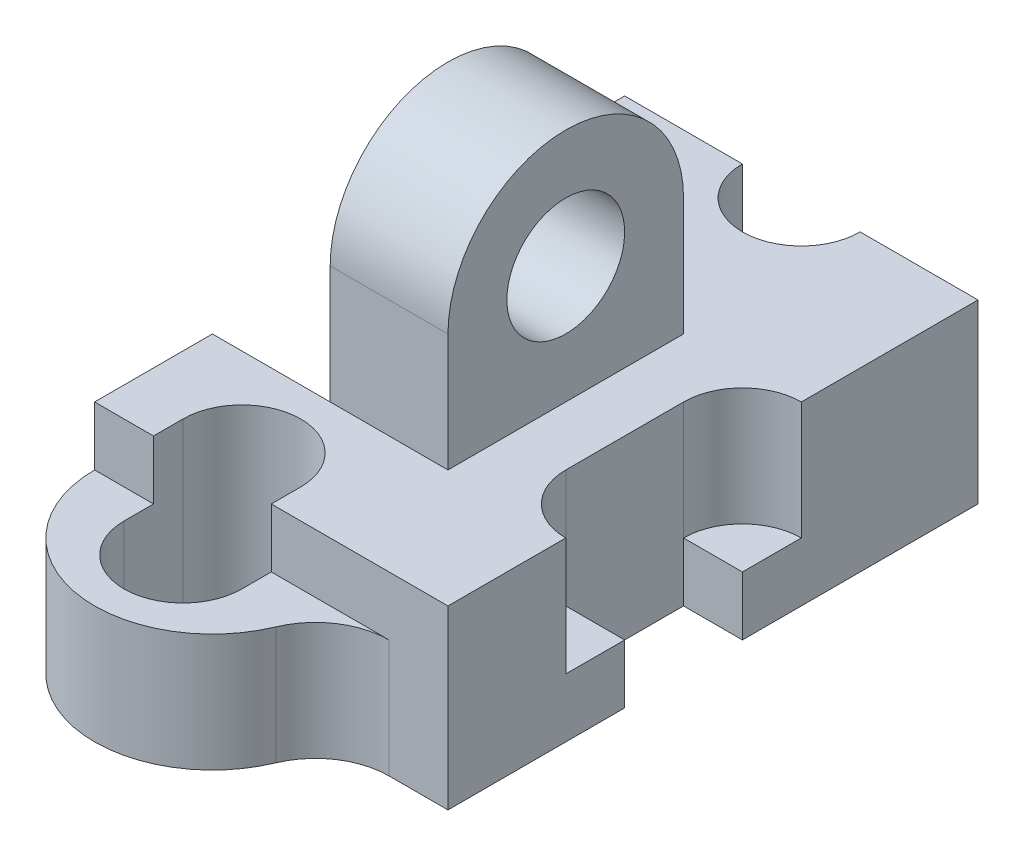
ISO-10303-21;
HEADER;
FILE_DESCRIPTION(('STEP AP214'),'2;1');
FILE_NAME('part.step','',(''),(''),'','','');
FILE_SCHEMA(('AUTOMOTIVE_DESIGN { 1 0 10303 214 1 1 1 1 }'));
ENDSEC;
DATA;
#1=APPLICATION_CONTEXT('core data for automotive mechanical design processes');
#2=APPLICATION_PROTOCOL_DEFINITION('international standard','automotive_design',2000,#1);
#3=PRODUCT_CONTEXT('',#1,'mechanical');
#4=PRODUCT('Part','Part','',(#3));
#5=PRODUCT_RELATED_PRODUCT_CATEGORY('part','',(#4));
#6=PRODUCT_DEFINITION_FORMATION('','',#4);
#7=PRODUCT_DEFINITION_CONTEXT('part definition',#1,'design');
#8=PRODUCT_DEFINITION('design','',#6,#7);
#9=PRODUCT_DEFINITION_SHAPE('','',#8);
#10=(LENGTH_UNIT() NAMED_UNIT(*) SI_UNIT(.MILLI.,.METRE.));
#11=(NAMED_UNIT(*) PLANE_ANGLE_UNIT() SI_UNIT($,.RADIAN.));
#12=(NAMED_UNIT(*) SI_UNIT($,.STERADIAN.) SOLID_ANGLE_UNIT());
#13=UNCERTAINTY_MEASURE_WITH_UNIT(LENGTH_MEASURE(1.E-05),#10,'distance_accuracy_value','');
#14=(GEOMETRIC_REPRESENTATION_CONTEXT(3) GLOBAL_UNCERTAINTY_ASSIGNED_CONTEXT((#13)) GLOBAL_UNIT_ASSIGNED_CONTEXT((#10,
#11,#12)) REPRESENTATION_CONTEXT('',''));
#15=CARTESIAN_POINT('',(0.,0.,0.));
#16=DIRECTION('',(0.,0.,1.));
#17=DIRECTION('',(1.,0.,0.));
#18=AXIS2_PLACEMENT_3D('',#15,#16,#17);
#19=CARTESIAN_POINT('',(-1.,3.5,3.));
#20=DIRECTION('',(1.,0.,0.));
#21=DIRECTION('',(0.,1.,0.));
#22=AXIS2_PLACEMENT_3D('',#19,#20,#21);
#23=PLANE('',#22);
#24=CARTESIAN_POINT('',(-1.,3.5,5.));
#25=DIRECTION('',(1.,0.,0.));
#26=DIRECTION('',(0.,1.,0.));
#27=AXIS2_PLACEMENT_3D('',#24,#25,#26);
#28=CIRCLE('',#27,1.);
#29=CARTESIAN_POINT('',(-1.,4.5,5.));
#30=VERTEX_POINT('',#29);
#31=EDGE_CURVE('E37',#30,#30,#28,.T.);
#32=ORIENTED_EDGE('',*,*,#31,.T.);
#33=EDGE_LOOP('',(#32));
#34=FACE_BOUND('',#33,.T.);
#35=DIRECTION('',(0.,0.,-1.));
#36=VECTOR('',#35,1.);
#37=CARTESIAN_POINT('',(-1.,1.5,7.));
#38=LINE('',#37,#36);
#39=CARTESIAN_POINT('',(-1.,1.5,7.));
#40=VERTEX_POINT('',#39);
#41=CARTESIAN_POINT('',(-1.,1.5,3.));
#42=VERTEX_POINT('',#41);
#43=EDGE_CURVE('E57',#40,#42,#38,.T.);
#44=ORIENTED_EDGE('',*,*,#43,.F.);
#45=DIRECTION('',(0.,-1.,0.));
#46=VECTOR('',#45,1.);
#47=CARTESIAN_POINT('',(-1.,3.5,7.));
#48=LINE('',#47,#46);
#49=CARTESIAN_POINT('',(-1.,3.5,7.));
#50=VERTEX_POINT('',#49);
#51=EDGE_CURVE('E285',#50,#40,#48,.T.);
#52=ORIENTED_EDGE('',*,*,#51,.F.);
#53=CARTESIAN_POINT('',(-1.,3.5,5.));
#54=DIRECTION('',(1.,0.,0.));
#55=DIRECTION('',(0.,-1.,0.));
#56=AXIS2_PLACEMENT_3D('',#53,#54,#55);
#57=CIRCLE('',#56,2.);
#58=CARTESIAN_POINT('',(-1.,3.5,3.));
#59=VERTEX_POINT('',#58);
#60=EDGE_CURVE('E263',#59,#50,#57,.T.);
#61=ORIENTED_EDGE('',*,*,#60,.F.);
#62=DIRECTION('',(0.,-1.,0.));
#63=VECTOR('',#62,1.);
#64=CARTESIAN_POINT('',(-1.,3.5,3.));
#65=LINE('',#64,#63);
#66=EDGE_CURVE('E288',#59,#42,#65,.T.);
#67=ORIENTED_EDGE('',*,*,#66,.T.);
#68=EDGE_LOOP('',(#44,#52,#61,#67));
#69=FACE_BOUND('',#68,.T.);
#70=ADVANCED_FACE('F33',(#34,#69),#23,.F.);
#71=CARTESIAN_POINT('',(-3.,-0.5,7.));
#72=DIRECTION('',(0.,0.,1.));
#73=DIRECTION('',(1.,0.,0.));
#74=AXIS2_PLACEMENT_3D('',#71,#72,#73);
#75=PLANE('',#74);
#76=CARTESIAN_POINT('',(-3.,1.5,7.));
#77=DIRECTION('',(0.,0.,1.));
#78=DIRECTION('',(1.,0.,0.));
#79=AXIS2_PLACEMENT_3D('',#76,#77,#78);
#80=CIRCLE('',#79,2.);
#81=CARTESIAN_POINT('',(-3.,-0.5,7.));
#82=VERTEX_POINT('',#81);
#83=EDGE_CURVE('E245',#40,#82,#80,.F.);
#84=ORIENTED_EDGE('',*,*,#83,.T.);
#85=DIRECTION('',(0.,1.,0.));
#86=VECTOR('',#85,1.);
#87=CARTESIAN_POINT('',(-3.,-0.5,7.));
#88=LINE('',#87,#86);
#89=CARTESIAN_POINT('',(-3.,1.5,7.));
#90=VERTEX_POINT('',#89);
#91=EDGE_CURVE('E230',#82,#90,#88,.T.);
#92=ORIENTED_EDGE('',*,*,#91,.T.);
#93=DIRECTION('',(1.,0.,0.));
#94=VECTOR('',#93,1.);
#95=CARTESIAN_POINT('',(-3.,1.5,7.));
#96=LINE('',#95,#94);
#97=EDGE_CURVE('E247',#90,#40,#96,.T.);
#98=ORIENTED_EDGE('',*,*,#97,.T.);
#99=EDGE_LOOP('',(#84,#92,#98));
#100=FACE_BOUND('',#99,.T.);
#101=ADVANCED_FACE('F246',(#100),#75,.F.);
#102=CARTESIAN_POINT('',(-1.,-0.5,3.));
#103=DIRECTION('',(0.,0.,-1.));
#104=DIRECTION('',(-1.,0.,0.));
#105=AXIS2_PLACEMENT_3D('',#102,#103,#104);
#106=PLANE('',#105);
#107=CARTESIAN_POINT('',(-3.,1.5,3.));
#108=DIRECTION('',(0.,0.,1.));
#109=DIRECTION('',(1.,0.,0.));
#110=AXIS2_PLACEMENT_3D('',#107,#108,#109);
#111=CIRCLE('',#110,2.);
#112=CARTESIAN_POINT('',(-3.,-0.5,3.));
#113=VERTEX_POINT('',#112);
#114=EDGE_CURVE('E250',#42,#113,#111,.F.);
#115=ORIENTED_EDGE('',*,*,#114,.F.);
#116=DIRECTION('',(-1.,0.,0.));
#117=VECTOR('',#116,1.);
#118=CARTESIAN_POINT('',(-1.,1.5,3.));
#119=LINE('',#118,#117);
#120=CARTESIAN_POINT('',(-3.,1.5,3.));
#121=VERTEX_POINT('',#120);
#122=EDGE_CURVE('E255',#42,#121,#119,.T.);
#123=ORIENTED_EDGE('',*,*,#122,.T.);
#124=DIRECTION('',(0.,1.,0.));
#125=VECTOR('',#124,1.);
#126=CARTESIAN_POINT('',(-3.,-0.5,3.));
#127=LINE('',#126,#125);
#128=EDGE_CURVE('E242',#113,#121,#127,.T.);
#129=ORIENTED_EDGE('',*,*,#128,.F.);
#130=EDGE_LOOP('',(#115,#123,#129));
#131=FACE_BOUND('',#130,.T.);
#132=ADVANCED_FACE('F569',(#131),#106,.F.);
#133=CARTESIAN_POINT('',(3.,1.5,9.));
#134=DIRECTION('',(0.,-1.,0.));
#135=DIRECTION('',(1.,0.,0.));
#136=AXIS2_PLACEMENT_3D('',#133,#134,#135);
#137=PLANE('',#136);
#138=DIRECTION('',(1.,0.,0.));
#139=VECTOR('',#138,1.);
#140=CARTESIAN_POINT('',(-1.,1.5,7.));
#141=LINE('',#140,#139);
#142=CARTESIAN_POINT('',(0.999999999999999,1.5,7.));
#143=VERTEX_POINT('',#142);
#144=EDGE_CURVE('E274',#40,#143,#141,.T.);
#145=ORIENTED_EDGE('',*,*,#144,.F.);
#146=ORIENTED_EDGE('',*,*,#97,.F.);
#147=DIRECTION('',(0.,0.,-1.));
#148=VECTOR('',#147,1.);
#149=CARTESIAN_POINT('',(-3.,1.5,9.));
#150=LINE('',#149,#148);
#151=CARTESIAN_POINT('',(-3.,1.5,9.));
#152=VERTEX_POINT('',#151);
#153=EDGE_CURVE('E238',#152,#90,#150,.T.);
#154=ORIENTED_EDGE('',*,*,#153,.F.);
#155=DIRECTION('',(-1.,0.,0.));
#156=VECTOR('',#155,1.);
#157=CARTESIAN_POINT('',(3.,1.5,9.));
#158=LINE('',#157,#156);
#159=CARTESIAN_POINT('',(-2.,1.5,9.));
#160=VERTEX_POINT('',#159);
#161=EDGE_CURVE('E426',#160,#152,#158,.T.);
#162=ORIENTED_EDGE('',*,*,#161,.F.);
#163=DIRECTION('',(0.,0.,-1.));
#164=VECTOR('',#163,1.);
#165=CARTESIAN_POINT('',(-2.,1.5,9.));
#166=LINE('',#165,#164);
#167=CARTESIAN_POINT('',(-2.,1.5,8.5));
#168=VERTEX_POINT('',#167);
#169=EDGE_CURVE('E381',#160,#168,#166,.T.);
#170=ORIENTED_EDGE('',*,*,#169,.T.);
#171=CARTESIAN_POINT('',(-1.,1.5,8.5));
#172=DIRECTION('',(0.,-1.,0.));
#173=DIRECTION('',(1.,0.,0.));
#174=AXIS2_PLACEMENT_3D('',#171,#172,#173);
#175=CIRCLE('',#174,1.);
#176=CARTESIAN_POINT('',(0.,1.5,8.5));
#177=VERTEX_POINT('',#176);
#178=EDGE_CURVE('E42',#168,#177,#175,.T.);
#179=ORIENTED_EDGE('',*,*,#178,.T.);
#180=DIRECTION('',(0.,0.,1.));
#181=VECTOR('',#180,1.);
#182=CARTESIAN_POINT('',(0.,1.5,9.));
#183=LINE('',#182,#181);
#184=CARTESIAN_POINT('',(0.,1.5,9.));
#185=VERTEX_POINT('',#184);
#186=EDGE_CURVE('E373',#177,#185,#183,.T.);
#187=ORIENTED_EDGE('',*,*,#186,.T.);
#188=CARTESIAN_POINT('',(3.,1.5,9.));
#189=VERTEX_POINT('',#188);
#190=EDGE_CURVE('E427',#189,#185,#158,.T.);
#191=ORIENTED_EDGE('',*,*,#190,.F.);
#192=DIRECTION('',(0.,0.,-1.));
#193=VECTOR('',#192,1.);
#194=CARTESIAN_POINT('',(3.,1.5,9.));
#195=LINE('',#194,#193);
#196=CARTESIAN_POINT('',(3.,1.5,7.));
#197=VERTEX_POINT('',#196);
#198=EDGE_CURVE('E445',#189,#197,#195,.T.);
#199=ORIENTED_EDGE('',*,*,#198,.T.);
#200=CARTESIAN_POINT('',(3.,1.5,6.));
#201=DIRECTION('',(0.,1.,0.));
#202=DIRECTION('',(-1.,0.,0.));
#203=AXIS2_PLACEMENT_3D('',#200,#201,#202);
#204=CIRCLE('',#203,1.);
#205=CARTESIAN_POINT('',(2.,1.5,6.));
#206=VERTEX_POINT('',#205);
#207=EDGE_CURVE('E316',#206,#197,#204,.T.);
#208=ORIENTED_EDGE('',*,*,#207,.F.);
#209=DIRECTION('',(0.,0.,1.));
#210=VECTOR('',#209,1.);
#211=CARTESIAN_POINT('',(2.,1.5,4.));
#212=LINE('',#211,#210);
#213=CARTESIAN_POINT('',(2.,1.5,4.));
#214=VERTEX_POINT('',#213);
#215=EDGE_CURVE('E321',#214,#206,#212,.T.);
#216=ORIENTED_EDGE('',*,*,#215,.F.);
#217=CARTESIAN_POINT('',(3.,1.5,4.));
#218=DIRECTION('',(0.,1.,0.));
#219=DIRECTION('',(-1.,0.,0.));
#220=AXIS2_PLACEMENT_3D('',#217,#218,#219);
#221=CIRCLE('',#220,0.999999999999999);
#222=CARTESIAN_POINT('',(3.,1.5,3.));
#223=VERTEX_POINT('',#222);
#224=EDGE_CURVE('E310',#223,#214,#221,.T.);
#225=ORIENTED_EDGE('',*,*,#224,.F.);
#226=CARTESIAN_POINT('',(3.,1.5,0.));
#227=VERTEX_POINT('',#226);
#228=EDGE_CURVE('E444',#223,#227,#195,.T.);
#229=ORIENTED_EDGE('',*,*,#228,.T.);
#230=DIRECTION('',(-1.,0.,0.));
#231=VECTOR('',#230,1.);
#232=CARTESIAN_POINT('',(3.,1.5,0.));
#233=LINE('',#232,#231);
#234=CARTESIAN_POINT('',(1.,1.5,0.));
#235=VERTEX_POINT('',#234);
#236=EDGE_CURVE('E422',#227,#235,#233,.T.);
#237=ORIENTED_EDGE('',*,*,#236,.T.);
#238=CARTESIAN_POINT('',(0.,1.5,0.));
#239=DIRECTION('',(0.,1.,0.));
#240=DIRECTION('',(-1.,0.,0.));
#241=AXIS2_PLACEMENT_3D('',#238,#239,#240);
#242=CIRCLE('',#241,1.);
#243=CARTESIAN_POINT('',(-1.,1.5,0.));
#244=VERTEX_POINT('',#243);
#245=EDGE_CURVE('E292',#244,#235,#242,.T.);
#246=ORIENTED_EDGE('',*,*,#245,.F.);
#247=CARTESIAN_POINT('',(-3.,1.5,0.));
#248=VERTEX_POINT('',#247);
#249=EDGE_CURVE('E440',#244,#248,#233,.T.);
#250=ORIENTED_EDGE('',*,*,#249,.T.);
#251=EDGE_CURVE('E430',#121,#248,#150,.T.);
#252=ORIENTED_EDGE('',*,*,#251,.F.);
#253=ORIENTED_EDGE('',*,*,#122,.F.);
#254=DIRECTION('',(-1.,0.,0.));
#255=VECTOR('',#254,1.);
#256=CARTESIAN_POINT('',(0.999999999999999,1.5,3.));
#257=LINE('',#256,#255);
#258=CARTESIAN_POINT('',(0.999999999999999,1.5,3.));
#259=VERTEX_POINT('',#258);
#260=EDGE_CURVE('E49',#259,#42,#257,.T.);
#261=ORIENTED_EDGE('',*,*,#260,.F.);
#262=DIRECTION('',(0.,0.,-1.));
#263=VECTOR('',#262,1.);
#264=CARTESIAN_POINT('',(0.999999999999999,1.5,7.));
#265=LINE('',#264,#263);
#266=EDGE_CURVE('E266',#143,#259,#265,.T.);
#267=ORIENTED_EDGE('',*,*,#266,.F.);
#268=EDGE_LOOP('',(#145,#146,#154,#162,#170,#179,#187,#191,#199,#208,#216,#225,#229,#237,#246,
#250,#252,#253,#261,#267));
#269=FACE_BOUND('',#268,.T.);
#270=ADVANCED_FACE('F463',(#269),#137,.F.);
#271=CARTESIAN_POINT('',(0.,0.,0.));
#272=DIRECTION('',(0.,0.,1.));
#273=DIRECTION('',(1.,0.,0.));
#274=AXIS2_PLACEMENT_3D('',#271,#272,#273);
#275=PLANE('',#274);
#276=DIRECTION('',(1.,0.,0.));
#277=VECTOR('',#276,1.);
#278=CARTESIAN_POINT('',(2.,-0.5,0.));
#279=LINE('',#278,#277);
#280=CARTESIAN_POINT('',(1.,-0.5,0.));
#281=VERTEX_POINT('',#280);
#282=CARTESIAN_POINT('',(2.,-0.5,0.));
#283=VERTEX_POINT('',#282);
#284=EDGE_CURVE('E302',#281,#283,#279,.T.);
#285=ORIENTED_EDGE('',*,*,#284,.F.);
#286=DIRECTION('',(0.,1.,0.));
#287=VECTOR('',#286,1.);
#288=CARTESIAN_POINT('',(1.,-1.5,0.));
#289=LINE('',#288,#287);
#290=EDGE_CURVE('E294',#281,#235,#289,.T.);
#291=ORIENTED_EDGE('',*,*,#290,.T.);
#292=ORIENTED_EDGE('',*,*,#236,.F.);
#293=DIRECTION('',(0.,1.,0.));
#294=VECTOR('',#293,1.);
#295=CARTESIAN_POINT('',(3.,-1.5,0.));
#296=LINE('',#295,#294);
#297=CARTESIAN_POINT('',(3.,-1.5,0.));
#298=VERTEX_POINT('',#297);
#299=EDGE_CURVE('E437',#298,#227,#296,.T.);
#300=ORIENTED_EDGE('',*,*,#299,.F.);
#301=DIRECTION('',(1.,0.,0.));
#302=VECTOR('',#301,1.);
#303=CARTESIAN_POINT('',(3.,-1.5,0.));
#304=LINE('',#303,#302);
#305=CARTESIAN_POINT('',(2.,-1.5,0.));
#306=VERTEX_POINT('',#305);
#307=EDGE_CURVE('E433',#306,#298,#304,.T.);
#308=ORIENTED_EDGE('',*,*,#307,.F.);
#309=DIRECTION('',(0.,-1.,0.));
#310=VECTOR('',#309,1.);
#311=CARTESIAN_POINT('',(2.,-0.5,0.));
#312=LINE('',#311,#310);
#313=EDGE_CURVE('E308',#283,#306,#312,.T.);
#314=ORIENTED_EDGE('',*,*,#313,.F.);
#315=EDGE_LOOP('',(#285,#291,#292,#300,#308,#314));
#316=FACE_BOUND('',#315,.T.);
#317=ADVANCED_FACE('F530',(#316),#275,.F.);
#318=CARTESIAN_POINT('',(3.,-1.5,9.));
#319=DIRECTION('',(-1.,0.,0.));
#320=DIRECTION('',(0.,0.,1.));
#321=AXIS2_PLACEMENT_3D('',#318,#319,#320);
#322=PLANE('',#321);
#323=DIRECTION('',(0.,0.,-1.));
#324=VECTOR('',#323,1.);
#325=CARTESIAN_POINT('',(3.,-0.5,9.));
#326=LINE('',#325,#324);
#327=CARTESIAN_POINT('',(3.,-0.5,7.));
#328=VERTEX_POINT('',#327);
#329=CARTESIAN_POINT('',(3.,-0.5,6.));
#330=VERTEX_POINT('',#329);
#331=EDGE_CURVE('E336',#328,#330,#326,.T.);
#332=ORIENTED_EDGE('',*,*,#331,.F.);
#333=DIRECTION('',(0.,1.,0.));
#334=VECTOR('',#333,1.);
#335=CARTESIAN_POINT('',(3.,-0.5,7.));
#336=LINE('',#335,#334);
#337=EDGE_CURVE('E327',#328,#197,#336,.T.);
#338=ORIENTED_EDGE('',*,*,#337,.T.);
#339=ORIENTED_EDGE('',*,*,#198,.F.);
#340=DIRECTION('',(0.,1.,0.));
#341=VECTOR('',#340,1.);
#342=CARTESIAN_POINT('',(3.,-1.5,9.));
#343=LINE('',#342,#341);
#344=CARTESIAN_POINT('',(3.,-1.5,9.));
#345=VERTEX_POINT('',#344);
#346=EDGE_CURVE('E424',#345,#189,#343,.T.);
#347=ORIENTED_EDGE('',*,*,#346,.F.);
#348=DIRECTION('',(0.,0.,-1.));
#349=VECTOR('',#348,1.);
#350=CARTESIAN_POINT('',(3.,-1.5,9.));
#351=LINE('',#350,#349);
#352=CARTESIAN_POINT('',(3.,-1.5,6.));
#353=VERTEX_POINT('',#352);
#354=EDGE_CURVE('E449',#345,#353,#351,.T.);
#355=ORIENTED_EDGE('',*,*,#354,.T.);
#356=DIRECTION('',(0.,-1.,0.));
#357=VECTOR('',#356,1.);
#358=CARTESIAN_POINT('',(3.,-0.5,6.));
#359=LINE('',#358,#357);
#360=EDGE_CURVE('E345',#330,#353,#359,.T.);
#361=ORIENTED_EDGE('',*,*,#360,.F.);
#362=EDGE_LOOP('',(#332,#338,#339,#347,#355,#361));
#363=FACE_BOUND('',#362,.T.);
#364=ADVANCED_FACE('F499',(#363),#322,.F.);
#365=CARTESIAN_POINT('',(0.,0.,9.));
#366=DIRECTION('',(0.,0.,1.));
#367=DIRECTION('',(1.,0.,0.));
#368=AXIS2_PLACEMENT_3D('',#365,#366,#367);
#369=PLANE('',#368);
#370=DIRECTION('',(0.,-1.,0.));
#371=VECTOR('',#370,1.);
#372=CARTESIAN_POINT('',(-2.,0.,9.));
#373=LINE('',#372,#371);
#374=CARTESIAN_POINT('',(-2.,0.5,9.));
#375=VERTEX_POINT('',#374);
#376=EDGE_CURVE('E379',#160,#375,#373,.T.);
#377=ORIENTED_EDGE('',*,*,#376,.F.);
#378=ORIENTED_EDGE('',*,*,#161,.T.);
#379=DIRECTION('',(0.,-1.,0.));
#380=VECTOR('',#379,1.);
#381=CARTESIAN_POINT('',(-3.,-1.5,9.));
#382=LINE('',#381,#380);
#383=CARTESIAN_POINT('',(-3.,0.5,9.));
#384=VERTEX_POINT('',#383);
#385=EDGE_CURVE('E418',#152,#384,#382,.T.);
#386=ORIENTED_EDGE('',*,*,#385,.T.);
#387=DIRECTION('',(1.,0.,0.));
#388=VECTOR('',#387,1.);
#389=CARTESIAN_POINT('',(2.,0.5,9.));
#390=LINE('',#389,#388);
#391=EDGE_CURVE('E399',#384,#375,#390,.T.);
#392=ORIENTED_EDGE('',*,*,#391,.T.);
#393=EDGE_LOOP('',(#377,#378,#386,#392));
#394=FACE_BOUND('',#393,.T.);
#395=ADVANCED_FACE('F623',(#394),#369,.T.);
#396=CARTESIAN_POINT('',(-3.,-1.5,9.));
#397=DIRECTION('',(1.,0.,0.));
#398=DIRECTION('',(0.,0.,-1.));
#399=AXIS2_PLACEMENT_3D('',#396,#397,#398);
#400=PLANE('',#399);
#401=ORIENTED_EDGE('',*,*,#153,.T.);
#402=ORIENTED_EDGE('',*,*,#91,.F.);
#403=DIRECTION('',(0.,0.,1.));
#404=VECTOR('',#403,1.);
#405=CARTESIAN_POINT('',(-3.,-0.5,3.));
#406=LINE('',#405,#404);
#407=EDGE_CURVE('E234',#113,#82,#406,.T.);
#408=ORIENTED_EDGE('',*,*,#407,.F.);
#409=ORIENTED_EDGE('',*,*,#128,.T.);
#410=ORIENTED_EDGE('',*,*,#251,.T.);
#411=DIRECTION('',(0.,-1.,0.));
#412=VECTOR('',#411,1.);
#413=CARTESIAN_POINT('',(-3.,-1.5,0.));
#414=LINE('',#413,#412);
#415=CARTESIAN_POINT('',(-3.,-1.5,0.));
#416=VERTEX_POINT('',#415);
#417=EDGE_CURVE('E412',#248,#416,#414,.T.);
#418=ORIENTED_EDGE('',*,*,#417,.T.);
#419=DIRECTION('',(0.,0.,-1.));
#420=VECTOR('',#419,1.);
#421=CARTESIAN_POINT('',(-3.,-1.5,9.));
#422=LINE('',#421,#420);
#423=CARTESIAN_POINT('',(-3.,-1.5,9.));
#424=VERTEX_POINT('',#423);
#425=EDGE_CURVE('E452',#424,#416,#422,.T.);
#426=ORIENTED_EDGE('',*,*,#425,.F.);
#427=DIRECTION('',(0.,-1.,0.));
#428=VECTOR('',#427,1.);
#429=CARTESIAN_POINT('',(-3.,0.5,9.));
#430=LINE('',#429,#428);
#431=EDGE_CURVE('E405',#384,#424,#430,.T.);
#432=ORIENTED_EDGE('',*,*,#431,.F.);
#433=ORIENTED_EDGE('',*,*,#385,.F.);
#434=EDGE_LOOP('',(#401,#402,#408,#409,#410,#418,#426,#432,#433));
#435=FACE_BOUND('',#434,.T.);
#436=ADVANCED_FACE('F35',(#435),#400,.F.);
#437=CARTESIAN_POINT('',(3.,-1.5,9.));
#438=DIRECTION('',(0.,1.,0.));
#439=DIRECTION('',(-1.,0.,0.));
#440=AXIS2_PLACEMENT_3D('',#437,#438,#439);
#441=PLANE('',#440);
#442=DIRECTION('',(0.,0.,1.));
#443=VECTOR('',#442,1.);
#444=CARTESIAN_POINT('',(-2.,-1.5,9.));
#445=LINE('',#444,#443);
#446=CARTESIAN_POINT('',(-2.,-1.5,8.5));
#447=VERTEX_POINT('',#446);
#448=CARTESIAN_POINT('',(-2.,-1.5,9.5));
#449=VERTEX_POINT('',#448);
#450=EDGE_CURVE('E384',#447,#449,#445,.T.);
#451=ORIENTED_EDGE('',*,*,#450,.T.);
#452=CARTESIAN_POINT('',(-1.,-1.5,9.5));
#453=DIRECTION('',(0.,1.,0.));
#454=DIRECTION('',(-1.,0.,0.));
#455=AXIS2_PLACEMENT_3D('',#452,#453,#454);
#456=CIRCLE('',#455,1.);
#457=CARTESIAN_POINT('',(0.,-1.5,9.5));
#458=VERTEX_POINT('',#457);
#459=EDGE_CURVE('E387',#449,#458,#456,.T.);
#460=ORIENTED_EDGE('',*,*,#459,.T.);
#461=DIRECTION('',(0.,0.,-1.));
#462=VECTOR('',#461,1.);
#463=CARTESIAN_POINT('',(0.,-1.5,9.));
#464=LINE('',#463,#462);
#465=CARTESIAN_POINT('',(0.,-1.5,8.5));
#466=VERTEX_POINT('',#465);
#467=EDGE_CURVE('E376',#458,#466,#464,.T.);
#468=ORIENTED_EDGE('',*,*,#467,.T.);
#469=CARTESIAN_POINT('',(-1.,-1.5,8.5));
#470=DIRECTION('',(0.,1.,0.));
#471=DIRECTION('',(-1.,0.,0.));
#472=AXIS2_PLACEMENT_3D('',#469,#470,#471);
#473=CIRCLE('',#472,1.);
#474=EDGE_CURVE('E390',#466,#447,#473,.T.);
#475=ORIENTED_EDGE('',*,*,#474,.T.);
#476=EDGE_LOOP('',(#451,#460,#468,#475));
#477=FACE_BOUND('',#476,.T.);
#478=CARTESIAN_POINT('',(-2.,-1.5,0.));
#479=VERTEX_POINT('',#478);
#480=EDGE_CURVE('E434',#416,#479,#304,.T.);
#481=ORIENTED_EDGE('',*,*,#480,.T.);
#482=CARTESIAN_POINT('',(0.,-1.5,0.));
#483=DIRECTION('',(0.,-1.,0.));
#484=DIRECTION('',(-1.,0.,0.));
#485=AXIS2_PLACEMENT_3D('',#482,#483,#484);
#486=CIRCLE('',#485,2.);
#487=EDGE_CURVE('E297',#306,#479,#486,.T.);
#488=ORIENTED_EDGE('',*,*,#487,.F.);
#489=ORIENTED_EDGE('',*,*,#307,.T.);
#490=CARTESIAN_POINT('',(3.,-1.5,4.));
#491=VERTEX_POINT('',#490);
#492=EDGE_CURVE('E448',#491,#298,#351,.T.);
#493=ORIENTED_EDGE('',*,*,#492,.F.);
#494=DIRECTION('',(1.,0.,0.));
#495=VECTOR('',#494,1.);
#496=CARTESIAN_POINT('',(3.,-1.5,4.));
#497=LINE('',#496,#495);
#498=CARTESIAN_POINT('',(2.,-1.5,4.));
#499=VERTEX_POINT('',#498);
#500=EDGE_CURVE('E343',#499,#491,#497,.T.);
#501=ORIENTED_EDGE('',*,*,#500,.F.);
#502=DIRECTION('',(0.,0.,-1.));
#503=VECTOR('',#502,1.);
#504=CARTESIAN_POINT('',(2.,-1.5,4.));
#505=LINE('',#504,#503);
#506=CARTESIAN_POINT('',(2.,-1.5,6.));
#507=VERTEX_POINT('',#506);
#508=EDGE_CURVE('E348',#507,#499,#505,.T.);
#509=ORIENTED_EDGE('',*,*,#508,.F.);
#510=DIRECTION('',(-1.,0.,0.));
#511=VECTOR('',#510,1.);
#512=CARTESIAN_POINT('',(2.,-1.5,6.));
#513=LINE('',#512,#511);
#514=EDGE_CURVE('E338',#353,#507,#513,.T.);
#515=ORIENTED_EDGE('',*,*,#514,.F.);
#516=ORIENTED_EDGE('',*,*,#354,.F.);
#517=DIRECTION('',(1.,0.,0.));
#518=VECTOR('',#517,1.);
#519=CARTESIAN_POINT('',(3.,-1.5,9.));
#520=LINE('',#519,#518);
#521=CARTESIAN_POINT('',(2.,-1.5,9.));
#522=VERTEX_POINT('',#521);
#523=EDGE_CURVE('E421',#522,#345,#520,.T.);
#524=ORIENTED_EDGE('',*,*,#523,.F.);
#525=CARTESIAN_POINT('',(2.,-1.5,10.25));
#526=DIRECTION('',(0.,1.,0.));
#527=DIRECTION('',(1.,0.,0.));
#528=AXIS2_PLACEMENT_3D('',#525,#526,#527);
#529=CIRCLE('',#528,1.25);
#530=CARTESIAN_POINT('',(0.846153846153846,-1.5,9.76923076923077));
#531=VERTEX_POINT('',#530);
#532=EDGE_CURVE('E398',#522,#531,#529,.T.);
#533=ORIENTED_EDGE('',*,*,#532,.T.);
#534=CARTESIAN_POINT('',(-1.,-1.5,9.));
#535=DIRECTION('',(0.,-1.,0.));
#536=DIRECTION('',(-1.,0.,0.));
#537=AXIS2_PLACEMENT_3D('',#534,#535,#536);
#538=CIRCLE('',#537,2.);
#539=EDGE_CURVE('E393',#531,#424,#538,.T.);
#540=ORIENTED_EDGE('',*,*,#539,.T.);
#541=ORIENTED_EDGE('',*,*,#425,.T.);
#542=EDGE_LOOP('',(#481,#488,#489,#493,#501,#509,#515,#516,#524,#533,#540,#541));
#543=FACE_BOUND('',#542,.T.);
#544=ADVANCED_FACE('F475',(#477,#543),#441,.F.);
#545=ORIENTED_EDGE('',*,*,#228,.F.);
#546=DIRECTION('',(0.,1.,0.));
#547=VECTOR('',#546,1.);
#548=CARTESIAN_POINT('',(3.,-0.5,3.));
#549=LINE('',#548,#547);
#550=CARTESIAN_POINT('',(3.,-0.5,3.));
#551=VERTEX_POINT('',#550);
#552=EDGE_CURVE('E332',#223,#551,#549,.F.);
#553=ORIENTED_EDGE('',*,*,#552,.T.);
#554=CARTESIAN_POINT('',(3.,-0.5,4.));
#555=VERTEX_POINT('',#554);
#556=EDGE_CURVE('E335',#555,#551,#326,.T.);
#557=ORIENTED_EDGE('',*,*,#556,.F.);
#558=DIRECTION('',(0.,-1.,0.));
#559=VECTOR('',#558,1.);
#560=CARTESIAN_POINT('',(3.,-0.5,4.));
#561=LINE('',#560,#559);
#562=EDGE_CURVE('E352',#555,#491,#561,.T.);
#563=ORIENTED_EDGE('',*,*,#562,.T.);
#564=ORIENTED_EDGE('',*,*,#492,.T.);
#565=ORIENTED_EDGE('',*,*,#299,.T.);
#566=EDGE_LOOP('',(#545,#553,#557,#563,#564,#565));
#567=FACE_BOUND('',#566,.T.);
#568=ADVANCED_FACE('F521',(#567),#322,.F.);
#569=DIRECTION('',(0.,1.,0.));
#570=VECTOR('',#569,1.);
#571=CARTESIAN_POINT('',(0.,0.,9.));
#572=LINE('',#571,#570);
#573=CARTESIAN_POINT('',(0.,0.5,9.));
#574=VERTEX_POINT('',#573);
#575=EDGE_CURVE('E364',#574,#185,#572,.T.);
#576=ORIENTED_EDGE('',*,*,#575,.F.);
#577=CARTESIAN_POINT('',(2.,0.5,9.));
#578=VERTEX_POINT('',#577);
#579=EDGE_CURVE('E397',#574,#578,#390,.T.);
#580=ORIENTED_EDGE('',*,*,#579,.T.);
#581=DIRECTION('',(0.,-1.,0.));
#582=VECTOR('',#581,1.);
#583=CARTESIAN_POINT('',(2.,0.5,9.));
#584=LINE('',#583,#582);
#585=EDGE_CURVE('E413',#578,#522,#584,.T.);
#586=ORIENTED_EDGE('',*,*,#585,.T.);
#587=ORIENTED_EDGE('',*,*,#523,.T.);
#588=ORIENTED_EDGE('',*,*,#346,.T.);
#589=ORIENTED_EDGE('',*,*,#190,.T.);
#590=EDGE_LOOP('',(#576,#580,#586,#587,#588,#589));
#591=FACE_BOUND('',#590,.T.);
#592=ADVANCED_FACE('F491',(#591),#369,.T.);
#593=ORIENTED_EDGE('',*,*,#249,.F.);
#594=DIRECTION('',(0.,1.,0.));
#595=VECTOR('',#594,1.);
#596=CARTESIAN_POINT('',(-1.,-1.5,0.));
#597=LINE('',#596,#595);
#598=CARTESIAN_POINT('',(-1.,-0.5,0.));
#599=VERTEX_POINT('',#598);
#600=EDGE_CURVE('E295',#599,#244,#597,.T.);
#601=ORIENTED_EDGE('',*,*,#600,.F.);
#602=CARTESIAN_POINT('',(-2.,-0.5,0.));
#603=VERTEX_POINT('',#602);
#604=EDGE_CURVE('E303',#603,#599,#279,.T.);
#605=ORIENTED_EDGE('',*,*,#604,.F.);
#606=DIRECTION('',(0.,-1.,0.));
#607=VECTOR('',#606,1.);
#608=CARTESIAN_POINT('',(-2.,-0.5,0.));
#609=LINE('',#608,#607);
#610=EDGE_CURVE('E306',#603,#479,#609,.T.);
#611=ORIENTED_EDGE('',*,*,#610,.T.);
#612=ORIENTED_EDGE('',*,*,#480,.F.);
#613=ORIENTED_EDGE('',*,*,#417,.F.);
#614=EDGE_LOOP('',(#593,#601,#605,#611,#612,#613));
#615=FACE_BOUND('',#614,.T.);
#616=ADVANCED_FACE('F539',(#615),#275,.F.);
#617=CARTESIAN_POINT('',(-1.,0.5,9.));
#618=DIRECTION('',(0.,-1.,0.));
#619=DIRECTION('',(1.,0.,0.));
#620=AXIS2_PLACEMENT_3D('',#617,#618,#619);
#621=CYLINDRICAL_SURFACE('',#620,2.);
#622=ORIENTED_EDGE('',*,*,#539,.F.);
#623=DIRECTION('',(0.,-1.,0.));
#624=VECTOR('',#623,1.);
#625=CARTESIAN_POINT('',(0.846153846153846,0.5,9.76923076923077));
#626=LINE('',#625,#624);
#627=CARTESIAN_POINT('',(0.846153846153846,0.5,9.76923076923077));
#628=VERTEX_POINT('',#627);
#629=EDGE_CURVE('E410',#628,#531,#626,.T.);
#630=ORIENTED_EDGE('',*,*,#629,.F.);
#631=CARTESIAN_POINT('',(-1.,0.5,9.));
#632=DIRECTION('',(0.,-1.,0.));
#633=DIRECTION('',(-1.,0.,0.));
#634=AXIS2_PLACEMENT_3D('',#631,#632,#633);
#635=CIRCLE('',#634,2.);
#636=EDGE_CURVE('E394',#628,#384,#635,.T.);
#637=ORIENTED_EDGE('',*,*,#636,.T.);
#638=ORIENTED_EDGE('',*,*,#431,.T.);
#639=EDGE_LOOP('',(#622,#630,#637,#638));
#640=FACE_BOUND('',#639,.T.);
#641=ADVANCED_FACE('F616',(#640),#621,.T.);
#642=CARTESIAN_POINT('',(2.,0.5,10.25));
#643=DIRECTION('',(0.,-1.,0.));
#644=DIRECTION('',(1.,0.,0.));
#645=AXIS2_PLACEMENT_3D('',#642,#643,#644);
#646=CYLINDRICAL_SURFACE('',#645,1.25);
#647=ORIENTED_EDGE('',*,*,#532,.F.);
#648=ORIENTED_EDGE('',*,*,#585,.F.);
#649=CARTESIAN_POINT('',(2.,0.5,10.25));
#650=DIRECTION('',(0.,1.,0.));
#651=DIRECTION('',(1.,0.,0.));
#652=AXIS2_PLACEMENT_3D('',#649,#650,#651);
#653=CIRCLE('',#652,1.25);
#654=EDGE_CURVE('E402',#578,#628,#653,.T.);
#655=ORIENTED_EDGE('',*,*,#654,.T.);
#656=ORIENTED_EDGE('',*,*,#629,.T.);
#657=EDGE_LOOP('',(#647,#648,#655,#656));
#658=FACE_BOUND('',#657,.T.);
#659=ADVANCED_FACE('F613',(#658),#646,.F.);
#660=CARTESIAN_POINT('',(-1.,0.5,9.));
#661=DIRECTION('',(0.,1.,0.));
#662=DIRECTION('',(-1.,0.,0.));
#663=AXIS2_PLACEMENT_3D('',#660,#661,#662);
#664=PLANE('',#663);
#665=DIRECTION('',(0.,0.,1.));
#666=VECTOR('',#665,1.);
#667=CARTESIAN_POINT('',(-2.,0.5,9.));
#668=LINE('',#667,#666);
#669=CARTESIAN_POINT('',(-2.,0.5,9.5));
#670=VERTEX_POINT('',#669);
#671=EDGE_CURVE('E460',#375,#670,#668,.T.);
#672=ORIENTED_EDGE('',*,*,#671,.F.);
#673=ORIENTED_EDGE('',*,*,#391,.F.);
#674=ORIENTED_EDGE('',*,*,#636,.F.);
#675=ORIENTED_EDGE('',*,*,#654,.F.);
#676=ORIENTED_EDGE('',*,*,#579,.F.);
#677=DIRECTION('',(0.,0.,-1.));
#678=VECTOR('',#677,1.);
#679=CARTESIAN_POINT('',(0.,0.5,9.));
#680=LINE('',#679,#678);
#681=CARTESIAN_POINT('',(0.,0.5,9.5));
#682=VERTEX_POINT('',#681);
#683=EDGE_CURVE('E455',#682,#574,#680,.T.);
#684=ORIENTED_EDGE('',*,*,#683,.F.);
#685=CARTESIAN_POINT('',(-1.,0.5,9.5));
#686=DIRECTION('',(0.,1.,0.));
#687=DIRECTION('',(-1.,0.,0.));
#688=AXIS2_PLACEMENT_3D('',#685,#686,#687);
#689=CIRCLE('',#688,1.);
#690=EDGE_CURVE('E457',#670,#682,#689,.T.);
#691=ORIENTED_EDGE('',*,*,#690,.F.);
#692=EDGE_LOOP('',(#672,#673,#674,#675,#676,#684,#691));
#693=FACE_BOUND('',#692,.T.);
#694=ADVANCED_FACE('F487',(#693),#664,.T.);
#695=CARTESIAN_POINT('',(-1.,-2.,8.5));
#696=DIRECTION('',(0.,1.,0.));
#697=DIRECTION('',(-1.,0.,0.));
#698=AXIS2_PLACEMENT_3D('',#695,#696,#697);
#699=CYLINDRICAL_SURFACE('',#698,1.);
#700=DIRECTION('',(0.,1.,0.));
#701=VECTOR('',#700,1.);
#702=CARTESIAN_POINT('',(0.,-2.,8.5));
#703=LINE('',#702,#701);
#704=EDGE_CURVE('E368',#466,#177,#703,.T.);
#705=ORIENTED_EDGE('',*,*,#704,.T.);
#706=ORIENTED_EDGE('',*,*,#178,.F.);
#707=DIRECTION('',(0.,1.,0.));
#708=VECTOR('',#707,1.);
#709=CARTESIAN_POINT('',(-2.,-2.,8.5));
#710=LINE('',#709,#708);
#711=EDGE_CURVE('E365',#447,#168,#710,.T.);
#712=ORIENTED_EDGE('',*,*,#711,.F.);
#713=ORIENTED_EDGE('',*,*,#474,.F.);
#714=EDGE_LOOP('',(#705,#706,#712,#713));
#715=FACE_BOUND('',#714,.T.);
#716=ADVANCED_FACE('F468',(#715),#699,.F.);
#717=CARTESIAN_POINT('',(-1.,-2.,9.5));
#718=DIRECTION('',(0.,1.,0.));
#719=DIRECTION('',(-1.,0.,0.));
#720=AXIS2_PLACEMENT_3D('',#717,#718,#719);
#721=CYLINDRICAL_SURFACE('',#720,1.);
#722=DIRECTION('',(0.,1.,0.));
#723=VECTOR('',#722,1.);
#724=CARTESIAN_POINT('',(-2.,-2.,9.5));
#725=LINE('',#724,#723);
#726=EDGE_CURVE('E361',#449,#670,#725,.T.);
#727=ORIENTED_EDGE('',*,*,#726,.T.);
#728=ORIENTED_EDGE('',*,*,#690,.T.);
#729=DIRECTION('',(0.,1.,0.));
#730=VECTOR('',#729,1.);
#731=CARTESIAN_POINT('',(0.,-2.,9.5));
#732=LINE('',#731,#730);
#733=EDGE_CURVE('E355',#458,#682,#732,.T.);
#734=ORIENTED_EDGE('',*,*,#733,.F.);
#735=ORIENTED_EDGE('',*,*,#459,.F.);
#736=EDGE_LOOP('',(#727,#728,#734,#735));
#737=FACE_BOUND('',#736,.T.);
#738=ADVANCED_FACE('F481',(#737),#721,.F.);
#739=CARTESIAN_POINT('',(-2.,-2.,9.5));
#740=DIRECTION('',(-1.,0.,0.));
#741=DIRECTION('',(0.,-1.,0.));
#742=AXIS2_PLACEMENT_3D('',#739,#740,#741);
#743=PLANE('',#742);
#744=ORIENTED_EDGE('',*,*,#711,.T.);
#745=ORIENTED_EDGE('',*,*,#169,.F.);
#746=ORIENTED_EDGE('',*,*,#376,.T.);
#747=ORIENTED_EDGE('',*,*,#671,.T.);
#748=ORIENTED_EDGE('',*,*,#726,.F.);
#749=ORIENTED_EDGE('',*,*,#450,.F.);
#750=EDGE_LOOP('',(#744,#745,#746,#747,#748,#749));
#751=FACE_BOUND('',#750,.T.);
#752=ADVANCED_FACE('F471',(#751),#743,.F.);
#753=CARTESIAN_POINT('',(0.,-2.,9.5));
#754=DIRECTION('',(1.,0.,0.));
#755=DIRECTION('',(0.,0.,-1.));
#756=AXIS2_PLACEMENT_3D('',#753,#754,#755);
#757=PLANE('',#756);
#758=ORIENTED_EDGE('',*,*,#733,.T.);
#759=ORIENTED_EDGE('',*,*,#683,.T.);
#760=ORIENTED_EDGE('',*,*,#575,.T.);
#761=ORIENTED_EDGE('',*,*,#186,.F.);
#762=ORIENTED_EDGE('',*,*,#704,.F.);
#763=ORIENTED_EDGE('',*,*,#467,.F.);
#764=EDGE_LOOP('',(#758,#759,#760,#761,#762,#763));
#765=FACE_BOUND('',#764,.T.);
#766=ADVANCED_FACE('F479',(#765),#757,.F.);
#767=CARTESIAN_POINT('',(3.,-0.5,4.));
#768=DIRECTION('',(0.,0.,-1.));
#769=DIRECTION('',(-1.,0.,0.));
#770=AXIS2_PLACEMENT_3D('',#767,#768,#769);
#771=PLANE('',#770);
#772=ORIENTED_EDGE('',*,*,#500,.T.);
#773=ORIENTED_EDGE('',*,*,#562,.F.);
#774=DIRECTION('',(1.,0.,0.));
#775=VECTOR('',#774,1.);
#776=CARTESIAN_POINT('',(3.,-0.5,4.));
#777=LINE('',#776,#775);
#778=CARTESIAN_POINT('',(2.,-0.5,4.));
#779=VERTEX_POINT('',#778);
#780=EDGE_CURVE('E342',#779,#555,#777,.T.);
#781=ORIENTED_EDGE('',*,*,#780,.F.);
#782=DIRECTION('',(0.,-1.,0.));
#783=VECTOR('',#782,1.);
#784=CARTESIAN_POINT('',(2.,-0.5,4.));
#785=LINE('',#784,#783);
#786=EDGE_CURVE('E356',#779,#499,#785,.T.);
#787=ORIENTED_EDGE('',*,*,#786,.T.);
#788=EDGE_LOOP('',(#772,#773,#781,#787));
#789=FACE_BOUND('',#788,.T.);
#790=ADVANCED_FACE('F595',(#789),#771,.F.);
#791=CARTESIAN_POINT('',(2.,-0.5,4.));
#792=DIRECTION('',(-1.,0.,0.));
#793=DIRECTION('',(0.,-1.,0.));
#794=AXIS2_PLACEMENT_3D('',#791,#792,#793);
#795=PLANE('',#794);
#796=ORIENTED_EDGE('',*,*,#508,.T.);
#797=ORIENTED_EDGE('',*,*,#786,.F.);
#798=DIRECTION('',(0.,1.,0.));
#799=VECTOR('',#798,1.);
#800=CARTESIAN_POINT('',(2.,-0.5,4.));
#801=LINE('',#800,#799);
#802=EDGE_CURVE('E319',#779,#214,#801,.T.);
#803=ORIENTED_EDGE('',*,*,#802,.T.);
#804=ORIENTED_EDGE('',*,*,#215,.T.);
#805=DIRECTION('',(0.,1.,0.));
#806=VECTOR('',#805,1.);
#807=CARTESIAN_POINT('',(2.,-0.5,6.));
#808=LINE('',#807,#806);
#809=CARTESIAN_POINT('',(2.,-0.5,6.));
#810=VERTEX_POINT('',#809);
#811=EDGE_CURVE('E325',#810,#206,#808,.T.);
#812=ORIENTED_EDGE('',*,*,#811,.F.);
#813=DIRECTION('',(0.,-1.,0.));
#814=VECTOR('',#813,1.);
#815=CARTESIAN_POINT('',(2.,-0.5,6.));
#816=LINE('',#815,#814);
#817=EDGE_CURVE('E358',#810,#507,#816,.T.);
#818=ORIENTED_EDGE('',*,*,#817,.T.);
#819=EDGE_LOOP('',(#796,#797,#803,#804,#812,#818));
#820=FACE_BOUND('',#819,.T.);
#821=ADVANCED_FACE('F513',(#820),#795,.F.);
#822=CARTESIAN_POINT('',(2.,-0.5,6.));
#823=DIRECTION('',(0.,0.,1.));
#824=DIRECTION('',(1.,0.,0.));
#825=AXIS2_PLACEMENT_3D('',#822,#823,#824);
#826=PLANE('',#825);
#827=ORIENTED_EDGE('',*,*,#514,.T.);
#828=ORIENTED_EDGE('',*,*,#817,.F.);
#829=DIRECTION('',(-1.,0.,0.));
#830=VECTOR('',#829,1.);
#831=CARTESIAN_POINT('',(2.,-0.5,6.));
#832=LINE('',#831,#830);
#833=EDGE_CURVE('E339',#330,#810,#832,.T.);
#834=ORIENTED_EDGE('',*,*,#833,.F.);
#835=ORIENTED_EDGE('',*,*,#360,.T.);
#836=EDGE_LOOP('',(#827,#828,#834,#835));
#837=FACE_BOUND('',#836,.T.);
#838=ADVANCED_FACE('F509',(#837),#826,.F.);
#839=CARTESIAN_POINT('',(3.,-0.5,4.));
#840=DIRECTION('',(0.,1.,0.));
#841=DIRECTION('',(-1.,0.,0.));
#842=AXIS2_PLACEMENT_3D('',#839,#840,#841);
#843=PLANE('',#842);
#844=ORIENTED_EDGE('',*,*,#331,.T.);
#845=ORIENTED_EDGE('',*,*,#833,.T.);
#846=CARTESIAN_POINT('',(3.,-0.5,6.));
#847=DIRECTION('',(0.,1.,0.));
#848=DIRECTION('',(-1.,0.,0.));
#849=AXIS2_PLACEMENT_3D('',#846,#847,#848);
#850=CIRCLE('',#849,1.);
#851=EDGE_CURVE('E315',#810,#328,#850,.T.);
#852=ORIENTED_EDGE('',*,*,#851,.T.);
#853=EDGE_LOOP('',(#844,#845,#852));
#854=FACE_BOUND('',#853,.T.);
#855=ADVANCED_FACE('F505',(#854),#843,.T.);
#856=ORIENTED_EDGE('',*,*,#556,.T.);
#857=CARTESIAN_POINT('',(3.,-0.5,4.));
#858=DIRECTION('',(0.,1.,0.));
#859=DIRECTION('',(-1.,0.,0.));
#860=AXIS2_PLACEMENT_3D('',#857,#858,#859);
#861=CIRCLE('',#860,0.999999999999999);
#862=EDGE_CURVE('E313',#551,#779,#861,.T.);
#863=ORIENTED_EDGE('',*,*,#862,.T.);
#864=ORIENTED_EDGE('',*,*,#780,.T.);
#865=EDGE_LOOP('',(#856,#863,#864));
#866=FACE_BOUND('',#865,.T.);
#867=ADVANCED_FACE('F589',(#866),#843,.T.);
#868=CARTESIAN_POINT('',(3.,-0.5,4.));
#869=DIRECTION('',(0.,1.,0.));
#870=DIRECTION('',(-1.,0.,0.));
#871=AXIS2_PLACEMENT_3D('',#868,#869,#870);
#872=CYLINDRICAL_SURFACE('',#871,0.999999999999999);
#873=ORIENTED_EDGE('',*,*,#224,.T.);
#874=ORIENTED_EDGE('',*,*,#802,.F.);
#875=ORIENTED_EDGE('',*,*,#862,.F.);
#876=ORIENTED_EDGE('',*,*,#552,.F.);
#877=EDGE_LOOP('',(#873,#874,#875,#876));
#878=FACE_BOUND('',#877,.T.);
#879=ADVANCED_FACE('F592',(#878),#872,.F.);
#880=CARTESIAN_POINT('',(3.,-0.5,6.));
#881=DIRECTION('',(0.,1.,0.));
#882=DIRECTION('',(-1.,0.,0.));
#883=AXIS2_PLACEMENT_3D('',#880,#881,#882);
#884=CYLINDRICAL_SURFACE('',#883,1.);
#885=ORIENTED_EDGE('',*,*,#851,.F.);
#886=ORIENTED_EDGE('',*,*,#811,.T.);
#887=ORIENTED_EDGE('',*,*,#207,.T.);
#888=ORIENTED_EDGE('',*,*,#337,.F.);
#889=EDGE_LOOP('',(#885,#886,#887,#888));
#890=FACE_BOUND('',#889,.T.);
#891=ADVANCED_FACE('F502',(#890),#884,.F.);
#892=CARTESIAN_POINT('',(0.,-0.5,0.));
#893=DIRECTION('',(0.,-1.,0.));
#894=DIRECTION('',(1.,0.,0.));
#895=AXIS2_PLACEMENT_3D('',#892,#893,#894);
#896=CYLINDRICAL_SURFACE('',#895,2.);
#897=ORIENTED_EDGE('',*,*,#487,.T.);
#898=ORIENTED_EDGE('',*,*,#610,.F.);
#899=CARTESIAN_POINT('',(0.,-0.5,0.));
#900=DIRECTION('',(0.,-1.,0.));
#901=DIRECTION('',(-1.,0.,0.));
#902=AXIS2_PLACEMENT_3D('',#899,#900,#901);
#903=CIRCLE('',#902,2.);
#904=EDGE_CURVE('E300',#283,#603,#903,.T.);
#905=ORIENTED_EDGE('',*,*,#904,.F.);
#906=ORIENTED_EDGE('',*,*,#313,.T.);
#907=EDGE_LOOP('',(#897,#898,#905,#906));
#908=FACE_BOUND('',#907,.T.);
#909=ADVANCED_FACE('F582',(#908),#896,.F.);
#910=CARTESIAN_POINT('',(0.,-0.5,0.));
#911=DIRECTION('',(0.,1.,0.));
#912=DIRECTION('',(-1.,0.,0.));
#913=AXIS2_PLACEMENT_3D('',#910,#911,#912);
#914=PLANE('',#913);
#915=ORIENTED_EDGE('',*,*,#604,.T.);
#916=CARTESIAN_POINT('',(0.,-0.5,0.));
#917=DIRECTION('',(0.,1.,0.));
#918=DIRECTION('',(-1.,0.,0.));
#919=AXIS2_PLACEMENT_3D('',#916,#917,#918);
#920=CIRCLE('',#919,1.);
#921=EDGE_CURVE('E11',#599,#281,#920,.T.);
#922=ORIENTED_EDGE('',*,*,#921,.T.);
#923=ORIENTED_EDGE('',*,*,#284,.T.);
#924=ORIENTED_EDGE('',*,*,#904,.T.);
#925=EDGE_LOOP('',(#915,#922,#923,#924));
#926=FACE_BOUND('',#925,.T.);
#927=ADVANCED_FACE('F579',(#926),#914,.F.);
#928=CARTESIAN_POINT('',(0.,-1.5,0.));
#929=DIRECTION('',(0.,1.,0.));
#930=DIRECTION('',(-1.,0.,0.));
#931=AXIS2_PLACEMENT_3D('',#928,#929,#930);
#932=CYLINDRICAL_SURFACE('',#931,1.);
#933=ORIENTED_EDGE('',*,*,#600,.T.);
#934=ORIENTED_EDGE('',*,*,#245,.T.);
#935=ORIENTED_EDGE('',*,*,#290,.F.);
#936=ORIENTED_EDGE('',*,*,#921,.F.);
#937=EDGE_LOOP('',(#933,#934,#935,#936));
#938=FACE_BOUND('',#937,.T.);
#939=ADVANCED_FACE('F575',(#938),#932,.F.);
#940=CARTESIAN_POINT('',(0.999999999999999,3.5,7.));
#941=DIRECTION('',(-1.,0.,0.));
#942=DIRECTION('',(0.,-1.,0.));
#943=AXIS2_PLACEMENT_3D('',#940,#941,#942);
#944=PLANE('',#943);
#945=CARTESIAN_POINT('',(0.999999999999999,3.5,5.));
#946=DIRECTION('',(1.,0.,0.));
#947=DIRECTION('',(0.,1.,0.));
#948=AXIS2_PLACEMENT_3D('',#945,#946,#947);
#949=CIRCLE('',#948,1.);
#950=CARTESIAN_POINT('',(0.999999999999999,4.5,5.));
#951=VERTEX_POINT('',#950);
#952=EDGE_CURVE('E241',#951,#951,#949,.T.);
#953=ORIENTED_EDGE('',*,*,#952,.F.);
#954=EDGE_LOOP('',(#953));
#955=FACE_BOUND('',#954,.T.);
#956=ORIENTED_EDGE('',*,*,#266,.T.);
#957=DIRECTION('',(0.,-1.,0.));
#958=VECTOR('',#957,1.);
#959=CARTESIAN_POINT('',(0.999999999999999,3.5,3.));
#960=LINE('',#959,#958);
#961=CARTESIAN_POINT('',(0.999999999999999,3.5,3.));
#962=VERTEX_POINT('',#961);
#963=EDGE_CURVE('E290',#962,#259,#960,.T.);
#964=ORIENTED_EDGE('',*,*,#963,.F.);
#965=CARTESIAN_POINT('',(0.999999999999999,3.5,5.));
#966=DIRECTION('',(1.,0.,0.));
#967=DIRECTION('',(0.,-1.,0.));
#968=AXIS2_PLACEMENT_3D('',#965,#966,#967);
#969=CIRCLE('',#968,2.);
#970=CARTESIAN_POINT('',(0.999999999999999,3.5,7.));
#971=VERTEX_POINT('',#970);
#972=EDGE_CURVE('E267',#962,#971,#969,.T.);
#973=ORIENTED_EDGE('',*,*,#972,.T.);
#974=DIRECTION('',(0.,-1.,0.));
#975=VECTOR('',#974,1.);
#976=CARTESIAN_POINT('',(0.999999999999999,3.5,7.));
#977=LINE('',#976,#975);
#978=EDGE_CURVE('E277',#971,#143,#977,.T.);
#979=ORIENTED_EDGE('',*,*,#978,.T.);
#980=EDGE_LOOP('',(#956,#964,#973,#979));
#981=FACE_BOUND('',#980,.T.);
#982=ADVANCED_FACE('F551',(#955,#981),#944,.F.);
#983=CARTESIAN_POINT('',(0.999999999999999,3.5,3.));
#984=DIRECTION('',(0.,0.,1.));
#985=DIRECTION('',(1.,0.,0.));
#986=AXIS2_PLACEMENT_3D('',#983,#984,#985);
#987=PLANE('',#986);
#988=ORIENTED_EDGE('',*,*,#260,.T.);
#989=ORIENTED_EDGE('',*,*,#66,.F.);
#990=DIRECTION('',(-1.,0.,0.));
#991=VECTOR('',#990,1.);
#992=CARTESIAN_POINT('',(0.999999999999999,3.5,3.));
#993=LINE('',#992,#991);
#994=EDGE_CURVE('E270',#962,#59,#993,.T.);
#995=ORIENTED_EDGE('',*,*,#994,.F.);
#996=ORIENTED_EDGE('',*,*,#963,.T.);
#997=EDGE_LOOP('',(#988,#989,#995,#996));
#998=FACE_BOUND('',#997,.T.);
#999=ADVANCED_FACE('F543',(#998),#987,.F.);
#1000=CARTESIAN_POINT('',(-1.,3.5,7.));
#1001=DIRECTION('',(0.,0.,-1.));
#1002=DIRECTION('',(-1.,0.,0.));
#1003=AXIS2_PLACEMENT_3D('',#1000,#1001,#1002);
#1004=PLANE('',#1003);
#1005=ORIENTED_EDGE('',*,*,#144,.T.);
#1006=ORIENTED_EDGE('',*,*,#978,.F.);
#1007=DIRECTION('',(1.,0.,0.));
#1008=VECTOR('',#1007,1.);
#1009=CARTESIAN_POINT('',(-1.,3.5,7.));
#1010=LINE('',#1009,#1008);
#1011=EDGE_CURVE('E273',#50,#971,#1010,.T.);
#1012=ORIENTED_EDGE('',*,*,#1011,.F.);
#1013=ORIENTED_EDGE('',*,*,#51,.T.);
#1014=EDGE_LOOP('',(#1005,#1006,#1012,#1013));
#1015=FACE_BOUND('',#1014,.T.);
#1016=ADVANCED_FACE('F553',(#1015),#1004,.F.);
#1017=CARTESIAN_POINT('',(-1.,3.5,5.));
#1018=DIRECTION('',(1.,0.,0.));
#1019=DIRECTION('',(0.,1.,0.));
#1020=AXIS2_PLACEMENT_3D('',#1017,#1018,#1019);
#1021=CYLINDRICAL_SURFACE('',#1020,2.);
#1022=ORIENTED_EDGE('',*,*,#972,.F.);
#1023=ORIENTED_EDGE('',*,*,#994,.T.);
#1024=ORIENTED_EDGE('',*,*,#60,.T.);
#1025=ORIENTED_EDGE('',*,*,#1011,.T.);
#1026=EDGE_LOOP('',(#1022,#1023,#1024,#1025));
#1027=FACE_BOUND('',#1026,.T.);
#1028=ADVANCED_FACE('F549',(#1027),#1021,.T.);
#1029=CARTESIAN_POINT('',(-3.,3.5,5.));
#1030=DIRECTION('',(1.,0.,0.));
#1031=DIRECTION('',(0.,1.,0.));
#1032=AXIS2_PLACEMENT_3D('',#1029,#1030,#1031);
#1033=CYLINDRICAL_SURFACE('',#1032,1.);
#1034=ORIENTED_EDGE('',*,*,#952,.T.);
#1035=EDGE_LOOP('',(#1034));
#1036=FACE_BOUND('',#1035,.T.);
#1037=ORIENTED_EDGE('',*,*,#31,.F.);
#1038=EDGE_LOOP('',(#1037));
#1039=FACE_BOUND('',#1038,.T.);
#1040=ADVANCED_FACE('F560',(#1036,#1039),#1033,.F.);
#1041=CARTESIAN_POINT('',(-3.,1.5,7.));
#1042=DIRECTION('',(0.,0.,-1.));
#1043=DIRECTION('',(-1.,0.,0.));
#1044=AXIS2_PLACEMENT_3D('',#1041,#1042,#1043);
#1045=CYLINDRICAL_SURFACE('',#1044,2.);
#1046=ORIENTED_EDGE('',*,*,#114,.T.);
#1047=ORIENTED_EDGE('',*,*,#407,.T.);
#1048=ORIENTED_EDGE('',*,*,#83,.F.);
#1049=ORIENTED_EDGE('',*,*,#43,.T.);
#1050=EDGE_LOOP('',(#1046,#1047,#1048,#1049));
#1051=FACE_BOUND('',#1050,.T.);
#1052=ADVANCED_FACE('F252',(#1051),#1045,.F.);
#1053=CLOSED_SHELL('',(#70,#101,#132,#270,#317,#364,#395,#436,#544,#568,#592,#616,#641,#659,
#694,#716,#738,#752,#766,#790,#821,#838,#855,#867,#879,#891,#909,#927,#939,#982,#999,#1016,
#1028,#1040,#1052));
#1054=MANIFOLD_SOLID_BREP('B2',#1053);
#1055=ADVANCED_BREP_SHAPE_REPRESENTATION('',(#18,#1054),#14);
#1056=SHAPE_DEFINITION_REPRESENTATION(#9,#1055);
ENDSEC;
END-ISO-10303-21;
